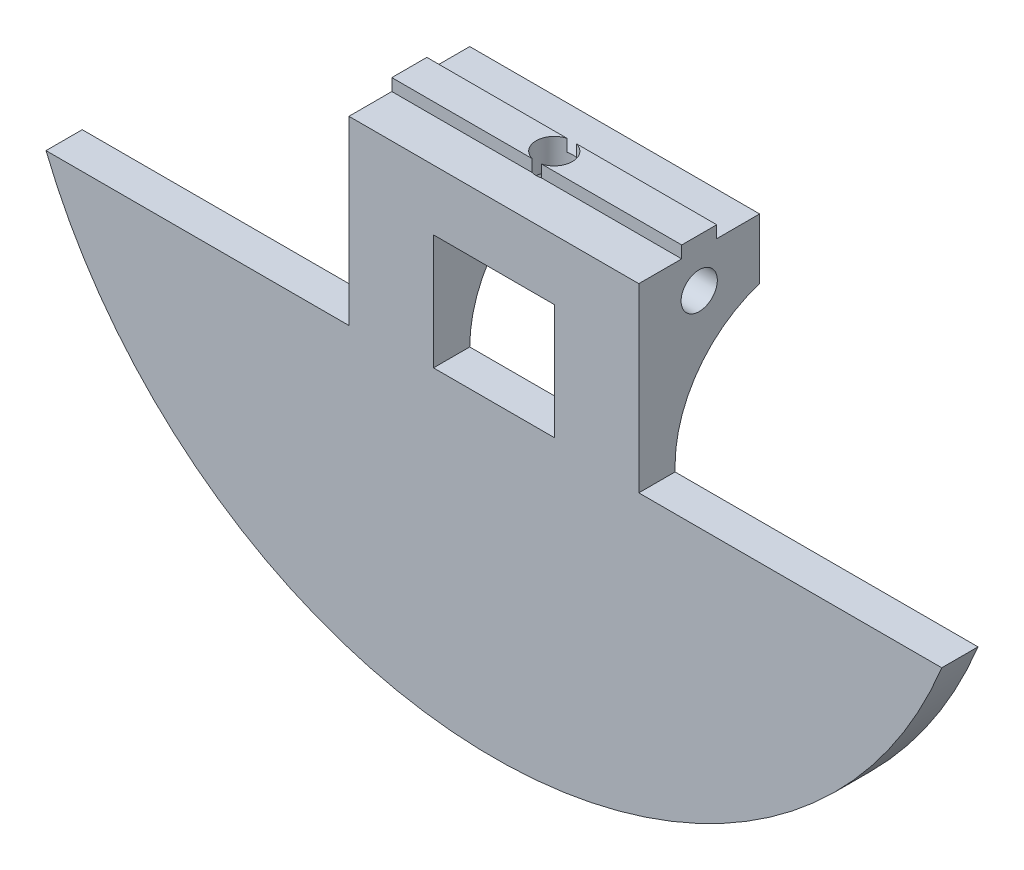
ISO-10303-21;
HEADER;
FILE_DESCRIPTION(('STEP AP214'),'2;1');
FILE_NAME('part.step','',(''),(''),'','','');
FILE_SCHEMA(('AUTOMOTIVE_DESIGN { 1 0 10303 214 1 1 1 1 }'));
ENDSEC;
DATA;
#1=APPLICATION_CONTEXT('core data for automotive mechanical design processes');
#2=APPLICATION_PROTOCOL_DEFINITION('international standard','automotive_design',2000,#1);
#3=PRODUCT_CONTEXT('',#1,'mechanical');
#4=PRODUCT('Part','Part','',(#3));
#5=PRODUCT_RELATED_PRODUCT_CATEGORY('part','',(#4));
#6=PRODUCT_DEFINITION_FORMATION('','',#4);
#7=PRODUCT_DEFINITION_CONTEXT('part definition',#1,'design');
#8=PRODUCT_DEFINITION('design','',#6,#7);
#9=PRODUCT_DEFINITION_SHAPE('','',#8);
#10=(LENGTH_UNIT() NAMED_UNIT(*) SI_UNIT(.MILLI.,.METRE.));
#11=(NAMED_UNIT(*) PLANE_ANGLE_UNIT() SI_UNIT($,.RADIAN.));
#12=(NAMED_UNIT(*) SI_UNIT($,.STERADIAN.) SOLID_ANGLE_UNIT());
#13=UNCERTAINTY_MEASURE_WITH_UNIT(LENGTH_MEASURE(1.E-05),#10,'distance_accuracy_value','');
#14=(GEOMETRIC_REPRESENTATION_CONTEXT(3) GLOBAL_UNCERTAINTY_ASSIGNED_CONTEXT((#13)) GLOBAL_UNIT_ASSIGNED_CONTEXT((#10,
#11,#12)) REPRESENTATION_CONTEXT('',''));
#15=CARTESIAN_POINT('',(0.,0.,0.));
#16=DIRECTION('',(0.,0.,1.));
#17=DIRECTION('',(1.,0.,0.));
#18=AXIS2_PLACEMENT_3D('',#15,#16,#17);
#19=CARTESIAN_POINT('',(0.,-40.,5.));
#20=DIRECTION('',(0.,1.,0.));
#21=DIRECTION('',(0.,0.,1.));
#22=AXIS2_PLACEMENT_3D('',#19,#20,#21);
#23=CYLINDRICAL_SURFACE('',#22,1.5);
#24=DIRECTION('',(0.,1.,0.));
#25=VECTOR('',#24,1.);
#26=CARTESIAN_POINT('',(0.384057287393432,-40.,6.45));
#27=LINE('',#26,#25);
#28=CARTESIAN_POINT('',(0.384057287393433,0.,6.45));
#29=VERTEX_POINT('',#28);
#30=CARTESIAN_POINT('',(0.384057287393433,1.,6.45));
#31=VERTEX_POINT('',#30);
#32=EDGE_CURVE('E279',#29,#31,#27,.T.);
#33=ORIENTED_EDGE('',*,*,#32,.T.);
#34=CARTESIAN_POINT('',(0.,1.,5.));
#35=DIRECTION('',(0.,1.,0.));
#36=DIRECTION('',(0.,0.,1.));
#37=AXIS2_PLACEMENT_3D('',#34,#35,#36);
#38=CIRCLE('',#37,1.5);
#39=CARTESIAN_POINT('',(0.384057287393429,1.,3.55));
#40=VERTEX_POINT('',#39);
#41=EDGE_CURVE('E294',#31,#40,#38,.T.);
#42=ORIENTED_EDGE('',*,*,#41,.T.);
#43=DIRECTION('',(0.,1.,0.));
#44=VECTOR('',#43,1.);
#45=CARTESIAN_POINT('',(0.384057287393433,-40.,3.55));
#46=LINE('',#45,#44);
#47=CARTESIAN_POINT('',(0.384057287393433,0.,3.55));
#48=VERTEX_POINT('',#47);
#49=EDGE_CURVE('E209',#40,#48,#46,.F.);
#50=ORIENTED_EDGE('',*,*,#49,.T.);
#51=CARTESIAN_POINT('',(0.,0.,5.));
#52=DIRECTION('',(0.,-1.,0.));
#53=DIRECTION('',(0.,0.,-1.));
#54=AXIS2_PLACEMENT_3D('',#51,#52,#53);
#55=CIRCLE('',#54,1.5);
#56=CARTESIAN_POINT('',(-0.384057287393433,0.,3.55));
#57=VERTEX_POINT('',#56);
#58=EDGE_CURVE('E291',#57,#48,#55,.T.);
#59=ORIENTED_EDGE('',*,*,#58,.F.);
#60=DIRECTION('',(0.,1.,0.));
#61=VECTOR('',#60,1.);
#62=CARTESIAN_POINT('',(-0.384057287393433,-40.,3.55));
#63=LINE('',#62,#61);
#64=CARTESIAN_POINT('',(-0.384057287393432,1.,3.55));
#65=VERTEX_POINT('',#64);
#66=EDGE_CURVE('E207',#57,#65,#63,.T.);
#67=ORIENTED_EDGE('',*,*,#66,.T.);
#68=CARTESIAN_POINT('',(-0.384057287393433,1.,6.45));
#69=VERTEX_POINT('',#68);
#70=EDGE_CURVE('E296',#65,#69,#38,.T.);
#71=ORIENTED_EDGE('',*,*,#70,.T.);
#72=DIRECTION('',(0.,1.,0.));
#73=VECTOR('',#72,1.);
#74=CARTESIAN_POINT('',(-0.384057287393432,-40.,6.45));
#75=LINE('',#74,#73);
#76=CARTESIAN_POINT('',(-0.384057287393432,0.,6.45));
#77=VERTEX_POINT('',#76);
#78=EDGE_CURVE('E289',#69,#77,#75,.F.);
#79=ORIENTED_EDGE('',*,*,#78,.T.);
#80=CARTESIAN_POINT('',(0.,0.,5.));
#81=DIRECTION('',(0.,-1.,0.));
#82=DIRECTION('',(0.,0.,-1.));
#83=AXIS2_PLACEMENT_3D('',#80,#81,#82);
#84=CIRCLE('',#83,1.5);
#85=EDGE_CURVE('E286',#29,#77,#84,.T.);
#86=ORIENTED_EDGE('',*,*,#85,.F.);
#87=EDGE_LOOP('',(#33,#42,#50,#59,#67,#71,#79,#86));
#88=FACE_BOUND('',#87,.T.);
#89=CARTESIAN_POINT('',(0.,-3.,5.));
#90=DIRECTION('',(0.707106781186547,0.707106781186547,0.));
#91=DIRECTION('',(-0.707106781186547,0.707106781186547,0.));
#92=AXIS2_PLACEMENT_3D('',#89,#90,#91);
#93=ELLIPSE('',#92,2.12132034355964,1.5);
#94=CARTESIAN_POINT('',(0.,-3.,6.5));
#95=VERTEX_POINT('',#94);
#96=CARTESIAN_POINT('',(0.,-3.,3.5));
#97=VERTEX_POINT('',#96);
#98=EDGE_CURVE('E45',#95,#97,#93,.F.);
#99=ORIENTED_EDGE('',*,*,#98,.T.);
#100=CARTESIAN_POINT('',(0.,-3.,5.));
#101=DIRECTION('',(-0.707106781186547,0.707106781186547,0.));
#102=DIRECTION('',(0.707106781186547,0.707106781186547,0.));
#103=AXIS2_PLACEMENT_3D('',#100,#101,#102);
#104=ELLIPSE('',#103,2.12132034355964,1.5);
#105=EDGE_CURVE('E11',#97,#95,#104,.F.);
#106=ORIENTED_EDGE('',*,*,#105,.T.);
#107=EDGE_LOOP('',(#99,#106));
#108=FACE_BOUND('',#107,.T.);
#109=ADVANCED_FACE('F32',(#88,#108),#23,.F.);
#110=CARTESIAN_POINT('',(-37.0809924354783,-14.5393920141695,-3.));
#111=DIRECTION('',(-1.,0.,0.));
#112=DIRECTION('',(0.,0.,1.));
#113=AXIS2_PLACEMENT_3D('',#110,#111,#112);
#114=CYLINDRICAL_SURFACE('',#113,10.);
#115=DIRECTION('',(-1.,0.,0.));
#116=VECTOR('',#115,1.);
#117=CARTESIAN_POINT('',(-37.0809924354783,-14.5393920141695,7.));
#118=LINE('',#117,#116);
#119=CARTESIAN_POINT('',(5.,-14.5393920141695,7.));
#120=VERTEX_POINT('',#119);
#121=CARTESIAN_POINT('',(12.,-14.5393920141695,7.));
#122=VERTEX_POINT('',#121);
#123=EDGE_CURVE('E203',#120,#122,#118,.F.);
#124=ORIENTED_EDGE('',*,*,#123,.F.);
#125=CARTESIAN_POINT('',(5.,-14.5393920141695,-3.));
#126=DIRECTION('',(1.,0.,0.));
#127=DIRECTION('',(0.,0.,-1.));
#128=AXIS2_PLACEMENT_3D('',#125,#126,#127);
#129=CIRCLE('',#128,10.);
#130=CARTESIAN_POINT('',(5.,-5.,0.));
#131=VERTEX_POINT('',#130);
#132=EDGE_CURVE('E184',#120,#131,#129,.F.);
#133=ORIENTED_EDGE('',*,*,#132,.T.);
#134=DIRECTION('',(1.,0.,0.));
#135=VECTOR('',#134,1.);
#136=CARTESIAN_POINT('',(-37.0809924354783,-5.,0.));
#137=LINE('',#136,#135);
#138=CARTESIAN_POINT('',(12.,-5.,0.));
#139=VERTEX_POINT('',#138);
#140=EDGE_CURVE('E310',#131,#139,#137,.T.);
#141=ORIENTED_EDGE('',*,*,#140,.T.);
#142=CARTESIAN_POINT('',(12.,-14.5393920141695,-3.));
#143=DIRECTION('',(-1.,0.,0.));
#144=DIRECTION('',(0.,0.,1.));
#145=AXIS2_PLACEMENT_3D('',#142,#143,#144);
#146=CIRCLE('',#145,10.);
#147=EDGE_CURVE('E196',#122,#139,#146,.T.);
#148=ORIENTED_EDGE('',*,*,#147,.F.);
#149=EDGE_LOOP('',(#124,#133,#141,#148));
#150=FACE_BOUND('',#149,.T.);
#151=ADVANCED_FACE('F407',(#150),#114,.F.);
#152=CARTESIAN_POINT('',(-15.0675723300356,0.,6.45));
#153=DIRECTION('',(0.,0.,1.));
#154=DIRECTION('',(1.,0.,0.));
#155=AXIS2_PLACEMENT_3D('',#152,#153,#154);
#156=PLANE('',#155);
#157=ORIENTED_EDGE('',*,*,#32,.F.);
#158=DIRECTION('',(1.,0.,0.));
#159=VECTOR('',#158,1.);
#160=CARTESIAN_POINT('',(-15.0675723300356,0.,6.45));
#161=LINE('',#160,#159);
#162=CARTESIAN_POINT('',(12.,0.,6.45));
#163=VERTEX_POINT('',#162);
#164=EDGE_CURVE('E257',#29,#163,#161,.T.);
#165=ORIENTED_EDGE('',*,*,#164,.T.);
#166=DIRECTION('',(0.,-1.,0.));
#167=VECTOR('',#166,1.);
#168=CARTESIAN_POINT('',(12.,0.,6.45));
#169=LINE('',#168,#167);
#170=CARTESIAN_POINT('',(12.,1.,6.45));
#171=VERTEX_POINT('',#170);
#172=EDGE_CURVE('E276',#171,#163,#169,.T.);
#173=ORIENTED_EDGE('',*,*,#172,.F.);
#174=DIRECTION('',(1.,0.,0.));
#175=VECTOR('',#174,1.);
#176=CARTESIAN_POINT('',(-15.0675723300356,1.,6.45));
#177=LINE('',#176,#175);
#178=EDGE_CURVE('E265',#31,#171,#177,.T.);
#179=ORIENTED_EDGE('',*,*,#178,.F.);
#180=EDGE_LOOP('',(#157,#165,#173,#179));
#181=FACE_BOUND('',#180,.T.);
#182=ADVANCED_FACE('F436',(#181),#156,.T.);
#183=CARTESIAN_POINT('',(-15.0675723300356,1.,6.45));
#184=DIRECTION('',(0.,1.,0.));
#185=DIRECTION('',(0.,0.,1.));
#186=AXIS2_PLACEMENT_3D('',#183,#184,#185);
#187=PLANE('',#186);
#188=ORIENTED_EDGE('',*,*,#41,.F.);
#189=ORIENTED_EDGE('',*,*,#178,.T.);
#190=DIRECTION('',(0.,0.,1.));
#191=VECTOR('',#190,1.);
#192=CARTESIAN_POINT('',(12.,1.,6.45));
#193=LINE('',#192,#191);
#194=CARTESIAN_POINT('',(12.,1.,3.55));
#195=VERTEX_POINT('',#194);
#196=EDGE_CURVE('E270',#195,#171,#193,.T.);
#197=ORIENTED_EDGE('',*,*,#196,.F.);
#198=DIRECTION('',(1.,0.,0.));
#199=VECTOR('',#198,1.);
#200=CARTESIAN_POINT('',(-15.0675723300356,1.,3.55));
#201=LINE('',#200,#199);
#202=EDGE_CURVE('E261',#40,#195,#201,.T.);
#203=ORIENTED_EDGE('',*,*,#202,.F.);
#204=EDGE_LOOP('',(#188,#189,#197,#203));
#205=FACE_BOUND('',#204,.T.);
#206=ADVANCED_FACE('F451',(#205),#187,.T.);
#207=CARTESIAN_POINT('',(-15.0675723300356,0.,3.55));
#208=DIRECTION('',(0.,0.,-1.));
#209=DIRECTION('',(-1.,0.,0.));
#210=AXIS2_PLACEMENT_3D('',#207,#208,#209);
#211=PLANE('',#210);
#212=ORIENTED_EDGE('',*,*,#66,.F.);
#213=DIRECTION('',(1.,0.,0.));
#214=VECTOR('',#213,1.);
#215=CARTESIAN_POINT('',(-15.0675723300356,0.,3.55));
#216=LINE('',#215,#214);
#217=CARTESIAN_POINT('',(-12.,0.,3.55));
#218=VERTEX_POINT('',#217);
#219=EDGE_CURVE('E258',#218,#57,#216,.T.);
#220=ORIENTED_EDGE('',*,*,#219,.F.);
#221=DIRECTION('',(0.,-1.,0.));
#222=VECTOR('',#221,1.);
#223=CARTESIAN_POINT('',(-12.,0.,3.55));
#224=LINE('',#223,#222);
#225=CARTESIAN_POINT('',(-12.,1.,3.55));
#226=VERTEX_POINT('',#225);
#227=EDGE_CURVE('E269',#226,#218,#224,.T.);
#228=ORIENTED_EDGE('',*,*,#227,.F.);
#229=EDGE_CURVE('E262',#226,#65,#201,.T.);
#230=ORIENTED_EDGE('',*,*,#229,.T.);
#231=EDGE_LOOP('',(#212,#220,#228,#230));
#232=FACE_BOUND('',#231,.T.);
#233=ADVANCED_FACE('F392',(#232),#211,.T.);
#234=CARTESIAN_POINT('',(-12.,0.,10.));
#235=DIRECTION('',(0.,-1.,0.));
#236=DIRECTION('',(0.,0.,-1.));
#237=AXIS2_PLACEMENT_3D('',#234,#235,#236);
#238=PLANE('',#237);
#239=ORIENTED_EDGE('',*,*,#164,.F.);
#240=ORIENTED_EDGE('',*,*,#85,.T.);
#241=CARTESIAN_POINT('',(-12.,0.,6.45));
#242=VERTEX_POINT('',#241);
#243=EDGE_CURVE('E253',#242,#77,#161,.T.);
#244=ORIENTED_EDGE('',*,*,#243,.F.);
#245=DIRECTION('',(0.,0.,-1.));
#246=VECTOR('',#245,1.);
#247=CARTESIAN_POINT('',(-12.,0.,10.));
#248=LINE('',#247,#246);
#249=CARTESIAN_POINT('',(-12.,0.,10.));
#250=VERTEX_POINT('',#249);
#251=EDGE_CURVE('E221',#250,#242,#248,.T.);
#252=ORIENTED_EDGE('',*,*,#251,.F.);
#253=DIRECTION('',(-1.,0.,0.));
#254=VECTOR('',#253,1.);
#255=CARTESIAN_POINT('',(-12.,0.,10.));
#256=LINE('',#255,#254);
#257=CARTESIAN_POINT('',(12.,0.,10.));
#258=VERTEX_POINT('',#257);
#259=EDGE_CURVE('E245',#258,#250,#256,.T.);
#260=ORIENTED_EDGE('',*,*,#259,.F.);
#261=DIRECTION('',(0.,0.,-1.));
#262=VECTOR('',#261,1.);
#263=CARTESIAN_POINT('',(12.,0.,10.));
#264=LINE('',#263,#262);
#265=EDGE_CURVE('E217',#258,#163,#264,.T.);
#266=ORIENTED_EDGE('',*,*,#265,.T.);
#267=EDGE_LOOP('',(#239,#240,#244,#252,#260,#266));
#268=FACE_BOUND('',#267,.T.);
#269=ADVANCED_FACE('F377',(#268),#238,.F.);
#270=CARTESIAN_POINT('',(0.,0.,10.));
#271=DIRECTION('',(0.,0.,-1.));
#272=DIRECTION('',(-1.,0.,0.));
#273=AXIS2_PLACEMENT_3D('',#270,#271,#272);
#274=CYLINDRICAL_SURFACE('',#273,40.);
#275=DIRECTION('',(0.,0.,-1.));
#276=VECTOR('',#275,1.);
#277=CARTESIAN_POINT('',(-37.0809924354783,-15.,10.));
#278=LINE('',#277,#276);
#279=CARTESIAN_POINT('',(-37.0809924354783,-15.,10.));
#280=VERTEX_POINT('',#279);
#281=CARTESIAN_POINT('',(-37.0809924354783,-15.,7.));
#282=VERTEX_POINT('',#281);
#283=EDGE_CURVE('E228',#280,#282,#278,.T.);
#284=ORIENTED_EDGE('',*,*,#283,.T.);
#285=CARTESIAN_POINT('',(0.,0.,7.));
#286=DIRECTION('',(0.,0.,1.));
#287=DIRECTION('',(1.,0.,0.));
#288=AXIS2_PLACEMENT_3D('',#285,#286,#287);
#289=CIRCLE('',#288,40.);
#290=CARTESIAN_POINT('',(37.0809924354783,-15.,7.));
#291=VERTEX_POINT('',#290);
#292=EDGE_CURVE('E303',#282,#291,#289,.T.);
#293=ORIENTED_EDGE('',*,*,#292,.T.);
#294=DIRECTION('',(0.,0.,-1.));
#295=VECTOR('',#294,1.);
#296=CARTESIAN_POINT('',(37.0809924354783,-15.,10.));
#297=LINE('',#296,#295);
#298=CARTESIAN_POINT('',(37.0809924354783,-15.,10.));
#299=VERTEX_POINT('',#298);
#300=EDGE_CURVE('E211',#299,#291,#297,.T.);
#301=ORIENTED_EDGE('',*,*,#300,.F.);
#302=CARTESIAN_POINT('',(0.,0.,10.));
#303=DIRECTION('',(0.,0.,1.));
#304=DIRECTION('',(-1.,0.,0.));
#305=AXIS2_PLACEMENT_3D('',#302,#303,#304);
#306=CIRCLE('',#305,40.);
#307=EDGE_CURVE('E235',#280,#299,#306,.T.);
#308=ORIENTED_EDGE('',*,*,#307,.F.);
#309=EDGE_LOOP('',(#284,#293,#301,#308));
#310=FACE_BOUND('',#309,.T.);
#311=ADVANCED_FACE('F459',(#310),#274,.T.);
#312=CARTESIAN_POINT('',(12.,-15.,10.));
#313=DIRECTION('',(0.,-1.,0.));
#314=DIRECTION('',(0.,0.,-1.));
#315=AXIS2_PLACEMENT_3D('',#312,#313,#314);
#316=PLANE('',#315);
#317=ORIENTED_EDGE('',*,*,#300,.T.);
#318=DIRECTION('',(-1.,0.,0.));
#319=VECTOR('',#318,1.);
#320=CARTESIAN_POINT('',(12.,-15.,7.));
#321=LINE('',#320,#319);
#322=CARTESIAN_POINT('',(12.,-15.,7.));
#323=VERTEX_POINT('',#322);
#324=EDGE_CURVE('E300',#291,#323,#321,.T.);
#325=ORIENTED_EDGE('',*,*,#324,.T.);
#326=DIRECTION('',(0.,0.,-1.));
#327=VECTOR('',#326,1.);
#328=CARTESIAN_POINT('',(12.,-15.,10.));
#329=LINE('',#328,#327);
#330=CARTESIAN_POINT('',(12.,-15.,10.));
#331=VERTEX_POINT('',#330);
#332=EDGE_CURVE('E214',#331,#323,#329,.T.);
#333=ORIENTED_EDGE('',*,*,#332,.F.);
#334=DIRECTION('',(-1.,0.,0.));
#335=VECTOR('',#334,1.);
#336=CARTESIAN_POINT('',(12.,-15.,10.));
#337=LINE('',#336,#335);
#338=EDGE_CURVE('E249',#299,#331,#337,.T.);
#339=ORIENTED_EDGE('',*,*,#338,.F.);
#340=EDGE_LOOP('',(#317,#325,#333,#339));
#341=FACE_BOUND('',#340,.T.);
#342=ADVANCED_FACE('F474',(#341),#316,.F.);
#343=CARTESIAN_POINT('',(12.,0.,10.));
#344=DIRECTION('',(-1.,0.,0.));
#345=DIRECTION('',(0.,0.,1.));
#346=AXIS2_PLACEMENT_3D('',#343,#344,#345);
#347=PLANE('',#346);
#348=CARTESIAN_POINT('',(12.,-3.,5.));
#349=DIRECTION('',(-1.,0.,0.));
#350=DIRECTION('',(0.,0.,1.));
#351=AXIS2_PLACEMENT_3D('',#348,#349,#350);
#352=CIRCLE('',#351,1.5);
#353=CARTESIAN_POINT('',(12.,-3.,6.5));
#354=VERTEX_POINT('',#353);
#355=EDGE_CURVE('E328',#354,#354,#352,.T.);
#356=ORIENTED_EDGE('',*,*,#355,.T.);
#357=EDGE_LOOP('',(#356));
#358=FACE_BOUND('',#357,.T.);
#359=ORIENTED_EDGE('',*,*,#332,.T.);
#360=DIRECTION('',(0.,1.,0.));
#361=VECTOR('',#360,1.);
#362=CARTESIAN_POINT('',(12.,0.,7.));
#363=LINE('',#362,#361);
#364=EDGE_CURVE('E297',#323,#122,#363,.T.);
#365=ORIENTED_EDGE('',*,*,#364,.T.);
#366=ORIENTED_EDGE('',*,*,#147,.T.);
#367=DIRECTION('',(0.,1.,0.));
#368=VECTOR('',#367,1.);
#369=CARTESIAN_POINT('',(12.,0.,0.));
#370=LINE('',#369,#368);
#371=CARTESIAN_POINT('',(12.,0.,0.));
#372=VERTEX_POINT('',#371);
#373=EDGE_CURVE('E239',#139,#372,#370,.T.);
#374=ORIENTED_EDGE('',*,*,#373,.T.);
#375=CARTESIAN_POINT('',(12.,0.,3.55));
#376=VERTEX_POINT('',#375);
#377=EDGE_CURVE('E220',#376,#372,#264,.T.);
#378=ORIENTED_EDGE('',*,*,#377,.F.);
#379=DIRECTION('',(0.,1.,0.));
#380=VECTOR('',#379,1.);
#381=CARTESIAN_POINT('',(12.,0.,3.55));
#382=LINE('',#381,#380);
#383=EDGE_CURVE('E273',#376,#195,#382,.T.);
#384=ORIENTED_EDGE('',*,*,#383,.T.);
#385=ORIENTED_EDGE('',*,*,#196,.T.);
#386=ORIENTED_EDGE('',*,*,#172,.T.);
#387=ORIENTED_EDGE('',*,*,#265,.F.);
#388=DIRECTION('',(0.,1.,0.));
#389=VECTOR('',#388,1.);
#390=CARTESIAN_POINT('',(12.,0.,10.));
#391=LINE('',#390,#389);
#392=EDGE_CURVE('E247',#331,#258,#391,.T.);
#393=ORIENTED_EDGE('',*,*,#392,.F.);
#394=EDGE_LOOP('',(#359,#365,#366,#374,#378,#384,#385,#386,#387,#393));
#395=FACE_BOUND('',#394,.T.);
#396=ADVANCED_FACE('F402',(#358,#395),#347,.F.);
#397=ORIENTED_EDGE('',*,*,#219,.T.);
#398=ORIENTED_EDGE('',*,*,#58,.T.);
#399=EDGE_CURVE('E256',#48,#376,#216,.T.);
#400=ORIENTED_EDGE('',*,*,#399,.T.);
#401=ORIENTED_EDGE('',*,*,#377,.T.);
#402=DIRECTION('',(-1.,0.,0.));
#403=VECTOR('',#402,1.);
#404=CARTESIAN_POINT('',(-12.,0.,0.));
#405=LINE('',#404,#403);
#406=CARTESIAN_POINT('',(-12.,0.,0.));
#407=VERTEX_POINT('',#406);
#408=EDGE_CURVE('E236',#372,#407,#405,.T.);
#409=ORIENTED_EDGE('',*,*,#408,.T.);
#410=EDGE_CURVE('E224',#218,#407,#248,.T.);
#411=ORIENTED_EDGE('',*,*,#410,.F.);
#412=EDGE_LOOP('',(#397,#398,#400,#401,#409,#411));
#413=FACE_BOUND('',#412,.T.);
#414=ADVANCED_FACE('F348',(#413),#238,.F.);
#415=CARTESIAN_POINT('',(-12.,-15.,10.));
#416=DIRECTION('',(1.,0.,0.));
#417=DIRECTION('',(0.,0.,-1.));
#418=AXIS2_PLACEMENT_3D('',#415,#416,#417);
#419=PLANE('',#418);
#420=CARTESIAN_POINT('',(-12.,-3.,5.));
#421=DIRECTION('',(-1.,0.,0.));
#422=DIRECTION('',(0.,0.,1.));
#423=AXIS2_PLACEMENT_3D('',#420,#421,#422);
#424=CIRCLE('',#423,1.5);
#425=CARTESIAN_POINT('',(-12.,-3.,6.5));
#426=VERTEX_POINT('',#425);
#427=EDGE_CURVE('E339',#426,#426,#424,.T.);
#428=ORIENTED_EDGE('',*,*,#427,.F.);
#429=EDGE_LOOP('',(#428));
#430=FACE_BOUND('',#429,.T.);
#431=DIRECTION('',(0.,-1.,0.));
#432=VECTOR('',#431,1.);
#433=CARTESIAN_POINT('',(-12.,-15.,0.));
#434=LINE('',#433,#432);
#435=CARTESIAN_POINT('',(-12.,-5.,0.));
#436=VERTEX_POINT('',#435);
#437=EDGE_CURVE('E232',#407,#436,#434,.T.);
#438=ORIENTED_EDGE('',*,*,#437,.T.);
#439=CARTESIAN_POINT('',(-12.,-14.5393920141695,-3.));
#440=DIRECTION('',(1.,0.,0.));
#441=DIRECTION('',(0.,0.,-1.));
#442=AXIS2_PLACEMENT_3D('',#439,#440,#441);
#443=CIRCLE('',#442,10.);
#444=CARTESIAN_POINT('',(-12.,-14.5393920141695,7.));
#445=VERTEX_POINT('',#444);
#446=EDGE_CURVE('E194',#436,#445,#443,.T.);
#447=ORIENTED_EDGE('',*,*,#446,.T.);
#448=DIRECTION('',(0.,-1.,0.));
#449=VECTOR('',#448,1.);
#450=CARTESIAN_POINT('',(-12.,-15.,7.));
#451=LINE('',#450,#449);
#452=CARTESIAN_POINT('',(-12.,-15.,7.));
#453=VERTEX_POINT('',#452);
#454=EDGE_CURVE('E305',#445,#453,#451,.T.);
#455=ORIENTED_EDGE('',*,*,#454,.T.);
#456=DIRECTION('',(0.,0.,-1.));
#457=VECTOR('',#456,1.);
#458=CARTESIAN_POINT('',(-12.,-15.,10.));
#459=LINE('',#458,#457);
#460=CARTESIAN_POINT('',(-12.,-15.,10.));
#461=VERTEX_POINT('',#460);
#462=EDGE_CURVE('E225',#461,#453,#459,.T.);
#463=ORIENTED_EDGE('',*,*,#462,.F.);
#464=DIRECTION('',(0.,-1.,0.));
#465=VECTOR('',#464,1.);
#466=CARTESIAN_POINT('',(-12.,-15.,10.));
#467=LINE('',#466,#465);
#468=EDGE_CURVE('E243',#250,#461,#467,.T.);
#469=ORIENTED_EDGE('',*,*,#468,.F.);
#470=ORIENTED_EDGE('',*,*,#251,.T.);
#471=DIRECTION('',(0.,1.,0.));
#472=VECTOR('',#471,1.);
#473=CARTESIAN_POINT('',(-12.,0.,6.45));
#474=LINE('',#473,#472);
#475=CARTESIAN_POINT('',(-12.,1.,6.45));
#476=VERTEX_POINT('',#475);
#477=EDGE_CURVE('E241',#242,#476,#474,.T.);
#478=ORIENTED_EDGE('',*,*,#477,.T.);
#479=DIRECTION('',(0.,0.,-1.));
#480=VECTOR('',#479,1.);
#481=CARTESIAN_POINT('',(-12.,1.,6.45));
#482=LINE('',#481,#480);
#483=EDGE_CURVE('E281',#476,#226,#482,.T.);
#484=ORIENTED_EDGE('',*,*,#483,.T.);
#485=ORIENTED_EDGE('',*,*,#227,.T.);
#486=ORIENTED_EDGE('',*,*,#410,.T.);
#487=EDGE_LOOP('',(#438,#447,#455,#463,#469,#470,#478,#484,#485,#486));
#488=FACE_BOUND('',#487,.T.);
#489=ADVANCED_FACE('F344',(#430,#488),#419,.F.);
#490=CARTESIAN_POINT('',(-37.0809924354783,-15.,10.));
#491=DIRECTION('',(0.,-1.,0.));
#492=DIRECTION('',(0.,0.,-1.));
#493=AXIS2_PLACEMENT_3D('',#490,#491,#492);
#494=PLANE('',#493);
#495=ORIENTED_EDGE('',*,*,#462,.T.);
#496=DIRECTION('',(-1.,0.,0.));
#497=VECTOR('',#496,1.);
#498=CARTESIAN_POINT('',(-37.0809924354783,-15.,7.));
#499=LINE('',#498,#497);
#500=EDGE_CURVE('E204',#453,#282,#499,.T.);
#501=ORIENTED_EDGE('',*,*,#500,.T.);
#502=ORIENTED_EDGE('',*,*,#283,.F.);
#503=DIRECTION('',(-1.,0.,0.));
#504=VECTOR('',#503,1.);
#505=CARTESIAN_POINT('',(-37.0809924354783,-15.,10.));
#506=LINE('',#505,#504);
#507=EDGE_CURVE('E231',#461,#280,#506,.T.);
#508=ORIENTED_EDGE('',*,*,#507,.F.);
#509=EDGE_LOOP('',(#495,#501,#502,#508));
#510=FACE_BOUND('',#509,.T.);
#511=ADVANCED_FACE('F347',(#510),#494,.F.);
#512=CARTESIAN_POINT('',(0.,0.,10.));
#513=DIRECTION('',(0.,0.,-1.));
#514=DIRECTION('',(-1.,0.,0.));
#515=AXIS2_PLACEMENT_3D('',#512,#513,#514);
#516=PLANE('',#515);
#517=DIRECTION('',(1.,0.,0.));
#518=VECTOR('',#517,1.);
#519=CARTESIAN_POINT('',(5.,-5.,10.));
#520=LINE('',#519,#518);
#521=CARTESIAN_POINT('',(-5.,-5.,10.));
#522=VERTEX_POINT('',#521);
#523=CARTESIAN_POINT('',(5.,-5.,10.));
#524=VERTEX_POINT('',#523);
#525=EDGE_CURVE('E319',#522,#524,#520,.T.);
#526=ORIENTED_EDGE('',*,*,#525,.T.);
#527=DIRECTION('',(0.,-1.,0.));
#528=VECTOR('',#527,1.);
#529=CARTESIAN_POINT('',(5.,-5.,10.));
#530=LINE('',#529,#528);
#531=CARTESIAN_POINT('',(5.,-14.5393920141695,10.));
#532=VERTEX_POINT('',#531);
#533=EDGE_CURVE('E327',#524,#532,#530,.T.);
#534=ORIENTED_EDGE('',*,*,#533,.T.);
#535=DIRECTION('',(-1.,0.,0.));
#536=VECTOR('',#535,1.);
#537=CARTESIAN_POINT('',(5.,-14.5393920141695,10.));
#538=LINE('',#537,#536);
#539=CARTESIAN_POINT('',(-5.,-14.5393920141695,10.));
#540=VERTEX_POINT('',#539);
#541=EDGE_CURVE('E332',#532,#540,#538,.T.);
#542=ORIENTED_EDGE('',*,*,#541,.T.);
#543=DIRECTION('',(0.,1.,0.));
#544=VECTOR('',#543,1.);
#545=CARTESIAN_POINT('',(-5.,-5.,10.));
#546=LINE('',#545,#544);
#547=EDGE_CURVE('E53',#540,#522,#546,.T.);
#548=ORIENTED_EDGE('',*,*,#547,.T.);
#549=EDGE_LOOP('',(#526,#534,#542,#548));
#550=FACE_BOUND('',#549,.T.);
#551=ORIENTED_EDGE('',*,*,#307,.T.);
#552=ORIENTED_EDGE('',*,*,#338,.T.);
#553=ORIENTED_EDGE('',*,*,#392,.T.);
#554=ORIENTED_EDGE('',*,*,#259,.T.);
#555=ORIENTED_EDGE('',*,*,#468,.T.);
#556=ORIENTED_EDGE('',*,*,#507,.T.);
#557=EDGE_LOOP('',(#551,#552,#553,#554,#555,#556));
#558=FACE_BOUND('',#557,.T.);
#559=ADVANCED_FACE('F369',(#550,#558),#516,.F.);
#560=CARTESIAN_POINT('',(0.,0.,0.));
#561=DIRECTION('',(0.,0.,-1.));
#562=DIRECTION('',(-1.,0.,0.));
#563=AXIS2_PLACEMENT_3D('',#560,#561,#562);
#564=PLANE('',#563);
#565=CARTESIAN_POINT('',(-5.,-5.,0.));
#566=VERTEX_POINT('',#565);
#567=EDGE_CURVE('E307',#436,#566,#137,.T.);
#568=ORIENTED_EDGE('',*,*,#567,.F.);
#569=ORIENTED_EDGE('',*,*,#437,.F.);
#570=ORIENTED_EDGE('',*,*,#408,.F.);
#571=ORIENTED_EDGE('',*,*,#373,.F.);
#572=ORIENTED_EDGE('',*,*,#140,.F.);
#573=DIRECTION('',(1.,0.,0.));
#574=VECTOR('',#573,1.);
#575=CARTESIAN_POINT('',(5.,-5.,0.));
#576=LINE('',#575,#574);
#577=EDGE_CURVE('E324',#566,#131,#576,.T.);
#578=ORIENTED_EDGE('',*,*,#577,.F.);
#579=EDGE_LOOP('',(#568,#569,#570,#571,#572,#578));
#580=FACE_BOUND('',#579,.T.);
#581=ADVANCED_FACE('F398',(#580),#564,.T.);
#582=ORIENTED_EDGE('',*,*,#78,.F.);
#583=EDGE_CURVE('E266',#476,#69,#177,.T.);
#584=ORIENTED_EDGE('',*,*,#583,.F.);
#585=ORIENTED_EDGE('',*,*,#477,.F.);
#586=ORIENTED_EDGE('',*,*,#243,.T.);
#587=EDGE_LOOP('',(#582,#584,#585,#586));
#588=FACE_BOUND('',#587,.T.);
#589=ADVANCED_FACE('F383',(#588),#156,.T.);
#590=ORIENTED_EDGE('',*,*,#70,.F.);
#591=ORIENTED_EDGE('',*,*,#229,.F.);
#592=ORIENTED_EDGE('',*,*,#483,.F.);
#593=ORIENTED_EDGE('',*,*,#583,.T.);
#594=EDGE_LOOP('',(#590,#591,#592,#593));
#595=FACE_BOUND('',#594,.T.);
#596=ADVANCED_FACE('F386',(#595),#187,.T.);
#597=ORIENTED_EDGE('',*,*,#49,.F.);
#598=ORIENTED_EDGE('',*,*,#202,.T.);
#599=ORIENTED_EDGE('',*,*,#383,.F.);
#600=ORIENTED_EDGE('',*,*,#399,.F.);
#601=EDGE_LOOP('',(#597,#598,#599,#600));
#602=FACE_BOUND('',#601,.T.);
#603=ADVANCED_FACE('F440',(#602),#211,.T.);
#604=CARTESIAN_POINT('',(0.,-3.,5.));
#605=DIRECTION('',(0.707106781186547,0.707106781186547,0.));
#606=DIRECTION('',(-0.707106781186547,0.707106781186547,0.));
#607=AXIS2_PLACEMENT_3D('',#604,#605,#606);
#608=ELLIPSE('',#607,2.12132034355964,1.5);
#609=EDGE_CURVE('E176',#95,#97,#608,.T.);
#610=ORIENTED_EDGE('',*,*,#609,.T.);
#611=CARTESIAN_POINT('',(0.,-3.,5.));
#612=DIRECTION('',(-0.707106781186547,0.707106781186547,0.));
#613=DIRECTION('',(0.707106781186547,0.707106781186547,0.));
#614=AXIS2_PLACEMENT_3D('',#611,#612,#613);
#615=ELLIPSE('',#614,2.12132034355964,1.5);
#616=EDGE_CURVE('E40',#97,#95,#615,.T.);
#617=ORIENTED_EDGE('',*,*,#616,.T.);
#618=EDGE_LOOP('',(#610,#617));
#619=FACE_BOUND('',#618,.T.);
#620=CARTESIAN_POINT('',(0.,-5.,5.));
#621=DIRECTION('',(0.,1.,0.));
#622=DIRECTION('',(0.,0.,1.));
#623=AXIS2_PLACEMENT_3D('',#620,#621,#622);
#624=CIRCLE('',#623,1.5);
#625=CARTESIAN_POINT('',(0.,-5.,6.5));
#626=VERTEX_POINT('',#625);
#627=EDGE_CURVE('E311',#626,#626,#624,.F.);
#628=ORIENTED_EDGE('',*,*,#627,.T.);
#629=EDGE_LOOP('',(#628));
#630=FACE_BOUND('',#629,.T.);
#631=ADVANCED_FACE('F186',(#619,#630),#23,.F.);
#632=CARTESIAN_POINT('',(-37.0809924354783,-5.,7.));
#633=DIRECTION('',(0.,0.,1.));
#634=DIRECTION('',(1.,0.,0.));
#635=AXIS2_PLACEMENT_3D('',#632,#633,#634);
#636=PLANE('',#635);
#637=ORIENTED_EDGE('',*,*,#454,.F.);
#638=CARTESIAN_POINT('',(-5.,-14.5393920141695,7.));
#639=VERTEX_POINT('',#638);
#640=EDGE_CURVE('E199',#445,#639,#118,.F.);
#641=ORIENTED_EDGE('',*,*,#640,.T.);
#642=EDGE_CURVE('E202',#639,#120,#118,.F.);
#643=ORIENTED_EDGE('',*,*,#642,.T.);
#644=ORIENTED_EDGE('',*,*,#123,.T.);
#645=ORIENTED_EDGE('',*,*,#364,.F.);
#646=ORIENTED_EDGE('',*,*,#324,.F.);
#647=ORIENTED_EDGE('',*,*,#292,.F.);
#648=ORIENTED_EDGE('',*,*,#500,.F.);
#649=EDGE_LOOP('',(#637,#641,#643,#644,#645,#646,#647,#648));
#650=FACE_BOUND('',#649,.T.);
#651=ADVANCED_FACE('F360',(#650),#636,.F.);
#652=ORIENTED_EDGE('',*,*,#567,.T.);
#653=CARTESIAN_POINT('',(-5.,-14.5393920141695,-3.));
#654=DIRECTION('',(-1.,0.,0.));
#655=DIRECTION('',(0.,0.,1.));
#656=AXIS2_PLACEMENT_3D('',#653,#654,#655);
#657=CIRCLE('',#656,10.);
#658=EDGE_CURVE('E191',#566,#639,#657,.F.);
#659=ORIENTED_EDGE('',*,*,#658,.T.);
#660=ORIENTED_EDGE('',*,*,#640,.F.);
#661=ORIENTED_EDGE('',*,*,#446,.F.);
#662=EDGE_LOOP('',(#652,#659,#660,#661));
#663=FACE_BOUND('',#662,.T.);
#664=ADVANCED_FACE('F34',(#663),#114,.F.);
#665=CARTESIAN_POINT('',(5.,-5.,10.));
#666=DIRECTION('',(1.,0.,0.));
#667=DIRECTION('',(0.,0.,-1.));
#668=AXIS2_PLACEMENT_3D('',#665,#666,#667);
#669=PLANE('',#668);
#670=DIRECTION('',(0.,0.,-1.));
#671=VECTOR('',#670,1.);
#672=CARTESIAN_POINT('',(5.,-14.5393920141695,10.));
#673=LINE('',#672,#671);
#674=EDGE_CURVE('E315',#532,#120,#673,.T.);
#675=ORIENTED_EDGE('',*,*,#674,.F.);
#676=ORIENTED_EDGE('',*,*,#533,.F.);
#677=DIRECTION('',(0.,0.,-1.));
#678=VECTOR('',#677,1.);
#679=CARTESIAN_POINT('',(5.,-5.,10.));
#680=LINE('',#679,#678);
#681=EDGE_CURVE('E314',#524,#131,#680,.T.);
#682=ORIENTED_EDGE('',*,*,#681,.T.);
#683=ORIENTED_EDGE('',*,*,#132,.F.);
#684=EDGE_LOOP('',(#675,#676,#682,#683));
#685=FACE_BOUND('',#684,.T.);
#686=ADVANCED_FACE('F409',(#685),#669,.F.);
#687=CARTESIAN_POINT('',(5.,-5.,10.));
#688=DIRECTION('',(0.,1.,0.));
#689=DIRECTION('',(0.,0.,1.));
#690=AXIS2_PLACEMENT_3D('',#687,#688,#689);
#691=PLANE('',#690);
#692=ORIENTED_EDGE('',*,*,#577,.T.);
#693=ORIENTED_EDGE('',*,*,#681,.F.);
#694=ORIENTED_EDGE('',*,*,#525,.F.);
#695=DIRECTION('',(0.,0.,-1.));
#696=VECTOR('',#695,1.);
#697=CARTESIAN_POINT('',(-5.,-5.,10.));
#698=LINE('',#697,#696);
#699=EDGE_CURVE('E321',#522,#566,#698,.T.);
#700=ORIENTED_EDGE('',*,*,#699,.T.);
#701=EDGE_LOOP('',(#692,#693,#694,#700));
#702=FACE_BOUND('',#701,.T.);
#703=ORIENTED_EDGE('',*,*,#627,.F.);
#704=EDGE_LOOP('',(#703));
#705=FACE_BOUND('',#704,.T.);
#706=ADVANCED_FACE('F417',(#702,#705),#691,.F.);
#707=CARTESIAN_POINT('',(-5.,-5.,10.));
#708=DIRECTION('',(-1.,0.,0.));
#709=DIRECTION('',(0.,0.,1.));
#710=AXIS2_PLACEMENT_3D('',#707,#708,#709);
#711=PLANE('',#710);
#712=ORIENTED_EDGE('',*,*,#699,.F.);
#713=ORIENTED_EDGE('',*,*,#547,.F.);
#714=DIRECTION('',(0.,0.,-1.));
#715=VECTOR('',#714,1.);
#716=CARTESIAN_POINT('',(-5.,-14.5393920141695,10.));
#717=LINE('',#716,#715);
#718=EDGE_CURVE('E318',#540,#639,#717,.T.);
#719=ORIENTED_EDGE('',*,*,#718,.T.);
#720=ORIENTED_EDGE('',*,*,#658,.F.);
#721=EDGE_LOOP('',(#712,#713,#719,#720));
#722=FACE_BOUND('',#721,.T.);
#723=ADVANCED_FACE('F419',(#722),#711,.F.);
#724=CARTESIAN_POINT('',(5.,-14.5393920141695,10.));
#725=DIRECTION('',(0.,-1.,0.));
#726=DIRECTION('',(0.,0.,-1.));
#727=AXIS2_PLACEMENT_3D('',#724,#725,#726);
#728=PLANE('',#727);
#729=ORIENTED_EDGE('',*,*,#718,.F.);
#730=ORIENTED_EDGE('',*,*,#541,.F.);
#731=ORIENTED_EDGE('',*,*,#674,.T.);
#732=ORIENTED_EDGE('',*,*,#642,.F.);
#733=EDGE_LOOP('',(#729,#730,#731,#732));
#734=FACE_BOUND('',#733,.T.);
#735=ADVANCED_FACE('F413',(#734),#728,.F.);
#736=CARTESIAN_POINT('',(37.0809924354783,-3.,5.));
#737=DIRECTION('',(-1.,0.,0.));
#738=DIRECTION('',(0.,0.,1.));
#739=AXIS2_PLACEMENT_3D('',#736,#737,#738);
#740=CYLINDRICAL_SURFACE('',#739,1.5);
#741=ORIENTED_EDGE('',*,*,#427,.T.);
#742=EDGE_LOOP('',(#741));
#743=FACE_BOUND('',#742,.T.);
#744=ORIENTED_EDGE('',*,*,#98,.F.);
#745=ORIENTED_EDGE('',*,*,#616,.F.);
#746=EDGE_LOOP('',(#744,#745));
#747=FACE_BOUND('',#746,.T.);
#748=ADVANCED_FACE('F183',(#743,#747),#740,.F.);
#749=ORIENTED_EDGE('',*,*,#609,.F.);
#750=ORIENTED_EDGE('',*,*,#105,.F.);
#751=EDGE_LOOP('',(#749,#750));
#752=FACE_BOUND('',#751,.T.);
#753=ORIENTED_EDGE('',*,*,#355,.F.);
#754=EDGE_LOOP('',(#753));
#755=FACE_BOUND('',#754,.T.);
#756=ADVANCED_FACE('F177',(#752,#755),#740,.F.);
#757=CLOSED_SHELL('',(#109,#151,#182,#206,#233,#269,#311,#342,#396,#414,#489,#511,#559,#581,
#589,#596,#603,#631,#651,#664,#686,#706,#723,#735,#748,#756));
#758=MANIFOLD_SOLID_BREP('B2',#757);
#759=ADVANCED_BREP_SHAPE_REPRESENTATION('',(#18,#758),#14);
#760=SHAPE_DEFINITION_REPRESENTATION(#9,#759);
ENDSEC;
END-ISO-10303-21;
